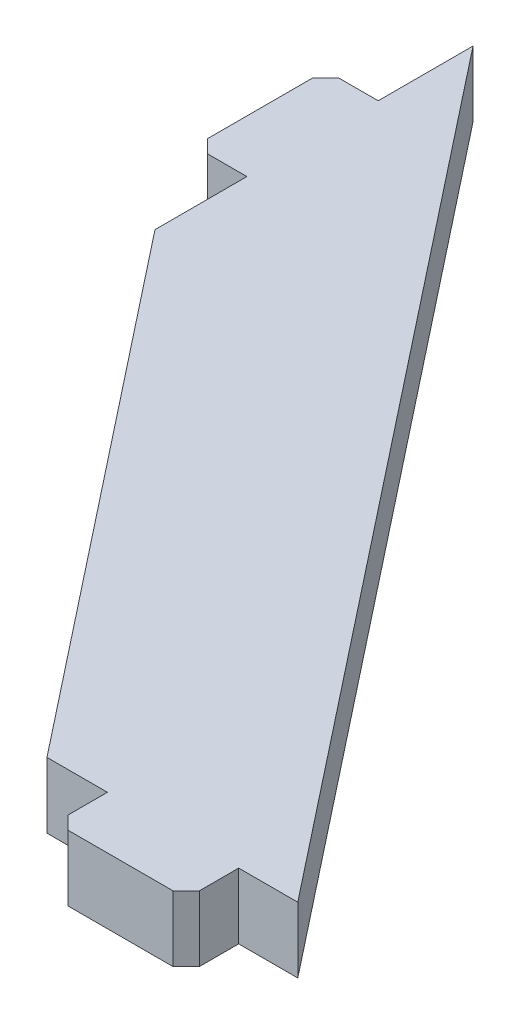
ISO-10303-21;
HEADER;
FILE_DESCRIPTION(('STEP AP214'),'2;1');
FILE_NAME('part.step','',(''),(''),'','','');
FILE_SCHEMA(('AUTOMOTIVE_DESIGN { 1 0 10303 214 1 1 1 1 }'));
ENDSEC;
DATA;
#1=APPLICATION_CONTEXT('core data for automotive mechanical design processes');
#2=APPLICATION_PROTOCOL_DEFINITION('international standard','automotive_design',2000,#1);
#3=PRODUCT_CONTEXT('',#1,'mechanical');
#4=PRODUCT('Part','Part','',(#3));
#5=PRODUCT_RELATED_PRODUCT_CATEGORY('part','',(#4));
#6=PRODUCT_DEFINITION_FORMATION('','',#4);
#7=PRODUCT_DEFINITION_CONTEXT('part definition',#1,'design');
#8=PRODUCT_DEFINITION('design','',#6,#7);
#9=PRODUCT_DEFINITION_SHAPE('','',#8);
#10=(LENGTH_UNIT() NAMED_UNIT(*) SI_UNIT(.MILLI.,.METRE.));
#11=(NAMED_UNIT(*) PLANE_ANGLE_UNIT() SI_UNIT($,.RADIAN.));
#12=(NAMED_UNIT(*) SI_UNIT($,.STERADIAN.) SOLID_ANGLE_UNIT());
#13=UNCERTAINTY_MEASURE_WITH_UNIT(LENGTH_MEASURE(1.E-05),#10,'distance_accuracy_value','');
#14=(GEOMETRIC_REPRESENTATION_CONTEXT(3) GLOBAL_UNCERTAINTY_ASSIGNED_CONTEXT((#13)) GLOBAL_UNIT_ASSIGNED_CONTEXT((#10,
#11,#12)) REPRESENTATION_CONTEXT('',''));
#15=CARTESIAN_POINT('',(0.,0.,0.));
#16=DIRECTION('',(0.,0.,1.));
#17=DIRECTION('',(1.,0.,0.));
#18=AXIS2_PLACEMENT_3D('',#15,#16,#17);
#19=CARTESIAN_POINT('',(-66.5,22.4999999999997,-9.28846153846134));
#20=DIRECTION('',(1.,0.,0.));
#21=DIRECTION('',(0.,0.,1.));
#22=AXIS2_PLACEMENT_3D('',#19,#20,#21);
#23=PLANE('',#22);
#24=DIRECTION('',(0.,0.,1.));
#25=VECTOR('',#24,1.);
#26=CARTESIAN_POINT('',(-66.5,22.4999999999997,-9.28846153846134));
#27=LINE('',#26,#25);
#28=CARTESIAN_POINT('',(-66.5000000000006,22.5,-91.8535742006211));
#29=VERTEX_POINT('',#28);
#30=CARTESIAN_POINT('',(-66.5000000000003,22.5,-77.8535742006211));
#31=VERTEX_POINT('',#30);
#32=EDGE_CURVE('E176',#29,#31,#27,.T.);
#33=ORIENTED_EDGE('',*,*,#32,.F.);
#34=CARTESIAN_POINT('',(-66.5000000000006,22.5,-91.8535742006211));
#35=CARTESIAN_POINT('',(-66.5000000000006,12.5,-91.8535742006211));
#36=B_SPLINE_CURVE_WITH_KNOTS('',1,(#34,#35),.UNSPECIFIED.,.F.,.F.,(2,2),(0.,0.166666666666667),.UNSPECIFIED.);
#37=CARTESIAN_POINT('',(-66.5000000000006,12.5,-91.8535742006211));
#38=VERTEX_POINT('',#37);
#39=EDGE_CURVE('E161',#29,#38,#36,.T.);
#40=ORIENTED_EDGE('',*,*,#39,.T.);
#41=DIRECTION('',(0.,0.,1.));
#42=VECTOR('',#41,1.);
#43=CARTESIAN_POINT('',(-66.5000000000004,12.4999999999997,-9.28846153846168));
#44=LINE('',#43,#42);
#45=CARTESIAN_POINT('',(-66.5000000000002,12.5,-77.8535742006211));
#46=VERTEX_POINT('',#45);
#47=EDGE_CURVE('E174',#38,#46,#44,.T.);
#48=ORIENTED_EDGE('',*,*,#47,.T.);
#49=DIRECTION('',(0.,1.,0.));
#50=VECTOR('',#49,1.);
#51=CARTESIAN_POINT('',(-66.5000000000003,22.5,-77.8535742006211));
#52=LINE('',#51,#50);
#53=EDGE_CURVE('E46',#46,#31,#52,.T.);
#54=ORIENTED_EDGE('',*,*,#53,.T.);
#55=EDGE_LOOP('',(#33,#40,#48,#54));
#56=FACE_BOUND('',#55,.T.);
#57=ADVANCED_FACE('F42',(#56),#23,.F.);
#58=CARTESIAN_POINT('',(-66.5000000000007,12.5000000000002,-126.300779169565));
#59=VERTEX_POINT('',#58);
#60=CARTESIAN_POINT('',(-66.5000000000003,12.5,-111.853574200621));
#61=VERTEX_POINT('',#60);
#62=EDGE_CURVE('E186',#59,#61,#44,.T.);
#63=ORIENTED_EDGE('',*,*,#62,.T.);
#64=CARTESIAN_POINT('',(-66.5000000000003,12.5,-111.853574200621));
#65=CARTESIAN_POINT('',(-66.5000000000003,22.5,-111.853574200621));
#66=B_SPLINE_CURVE_WITH_KNOTS('',1,(#64,#65),.UNSPECIFIED.,.F.,.F.,(2,2),(0.5,
0.666666666666667),.UNSPECIFIED.);
#67=CARTESIAN_POINT('',(-66.5000000000004,22.5,-111.853574200621));
#68=VERTEX_POINT('',#67);
#69=EDGE_CURVE('E170',#61,#68,#66,.T.);
#70=ORIENTED_EDGE('',*,*,#69,.T.);
#71=CARTESIAN_POINT('',(-66.5000000000008,22.5000000000002,-126.300779169565));
#72=VERTEX_POINT('',#71);
#73=EDGE_CURVE('E242',#72,#68,#27,.T.);
#74=ORIENTED_EDGE('',*,*,#73,.F.);
#75=DIRECTION('',(0.,1.,0.));
#76=VECTOR('',#75,1.);
#77=CARTESIAN_POINT('',(-66.5000000000008,22.5000000000002,-126.300779169565));
#78=LINE('',#77,#76);
#79=EDGE_CURVE('E209',#59,#72,#78,.T.);
#80=ORIENTED_EDGE('',*,*,#79,.F.);
#81=EDGE_LOOP('',(#63,#70,#74,#80));
#82=FACE_BOUND('',#81,.T.);
#83=ADVANCED_FACE('F373',(#82),#23,.F.);
#84=CARTESIAN_POINT('',(25.778135771357,22.5,3.88578058618805E-13));
#85=DIRECTION('',(0.,0.,-1.));
#86=DIRECTION('',(1.,0.,0.));
#87=AXIS2_PLACEMENT_3D('',#84,#85,#86);
#88=PLANE('',#87);
#89=CARTESIAN_POINT('',(24.1031929303425,12.5,1.73472347597681E-13));
#90=CARTESIAN_POINT('',(24.1031929303425,22.5,1.73472347597681E-13));
#91=B_SPLINE_CURVE_WITH_KNOTS('',1,(#89,#90),.UNSPECIFIED.,.F.,.F.,(2,2),(0.,0.166666666666667),.UNSPECIFIED.);
#92=CARTESIAN_POINT('',(24.1031929303425,12.5,1.73472347597681E-13));
#93=VERTEX_POINT('',#92);
#94=CARTESIAN_POINT('',(24.1031929303425,22.5,1.94289029309402E-13));
#95=VERTEX_POINT('',#94);
#96=EDGE_CURVE('E272',#93,#95,#91,.T.);
#97=ORIENTED_EDGE('',*,*,#96,.F.);
#98=DIRECTION('',(1.,0.,0.));
#99=VECTOR('',#98,1.);
#100=CARTESIAN_POINT('',(25.778135771357,12.5,1.73472347597681E-13));
#101=LINE('',#100,#99);
#102=CARTESIAN_POINT('',(33.1031929303425,12.5,1.73472347597681E-13));
#103=VERTEX_POINT('',#102);
#104=EDGE_CURVE('E206',#93,#103,#101,.T.);
#105=ORIENTED_EDGE('',*,*,#104,.T.);
#106=DIRECTION('',(0.,1.,0.));
#107=VECTOR('',#106,1.);
#108=CARTESIAN_POINT('',(33.1031929303425,22.5000000000006,1.94289029309402E-13));
#109=LINE('',#108,#107);
#110=CARTESIAN_POINT('',(33.1031929303425,22.5000000000006,1.94289029309402E-13));
#111=VERTEX_POINT('',#110);
#112=EDGE_CURVE('E52',#103,#111,#109,.T.);
#113=ORIENTED_EDGE('',*,*,#112,.T.);
#114=DIRECTION('',(1.,0.,0.));
#115=VECTOR('',#114,1.);
#116=CARTESIAN_POINT('',(25.778135771357,22.5,3.88578058618805E-13));
#117=LINE('',#116,#115);
#118=EDGE_CURVE('E67',#95,#111,#117,.T.);
#119=ORIENTED_EDGE('',*,*,#118,.F.);
#120=EDGE_LOOP('',(#97,#105,#113,#119));
#121=FACE_BOUND('',#120,.T.);
#122=ADVANCED_FACE('F217',(#121),#88,.F.);
#123=CARTESIAN_POINT('',(4.10319293034247,22.5,3.67761376907083E-13));
#124=CARTESIAN_POINT('',(4.1031929303425,12.5,1.73472347597681E-13));
#125=B_SPLINE_CURVE_WITH_KNOTS('',1,(#123,#124),.UNSPECIFIED.,.F.,.F.,(2,2),(0.5,
0.666666666666667),.UNSPECIFIED.);
#126=CARTESIAN_POINT('',(4.10319293034247,22.5,3.88578058618805E-13));
#127=VERTEX_POINT('',#126);
#128=CARTESIAN_POINT('',(4.1031929303425,12.5,1.73472347597681E-13));
#129=VERTEX_POINT('',#128);
#130=EDGE_CURVE('E278',#127,#129,#125,.T.);
#131=ORIENTED_EDGE('',*,*,#130,.F.);
#132=CARTESIAN_POINT('',(-5.10319293034245,22.5000000000004,1.94289029309402E-13));
#133=VERTEX_POINT('',#132);
#134=EDGE_CURVE('E226',#133,#127,#117,.T.);
#135=ORIENTED_EDGE('',*,*,#134,.F.);
#136=DIRECTION('',(0.,1.,0.));
#137=VECTOR('',#136,1.);
#138=CARTESIAN_POINT('',(-5.10319293034245,22.5000000000004,1.94289029309402E-13));
#139=LINE('',#138,#137);
#140=CARTESIAN_POINT('',(-5.10319293034242,12.5,1.73472347597681E-13));
#141=VERTEX_POINT('',#140);
#142=EDGE_CURVE('E11',#141,#133,#139,.T.);
#143=ORIENTED_EDGE('',*,*,#142,.F.);
#144=EDGE_CURVE('E203',#141,#129,#101,.T.);
#145=ORIENTED_EDGE('',*,*,#144,.T.);
#146=EDGE_LOOP('',(#131,#135,#143,#145));
#147=FACE_BOUND('',#146,.T.);
#148=ADVANCED_FACE('F396',(#147),#88,.F.);
#149=CARTESIAN_POINT('',(25.778135771357,22.5,-9.28846153846128));
#150=DIRECTION('',(-0.785209051423798,0.,0.619230769230777));
#151=DIRECTION('',(-0.619230769230777,0.,-0.785209051423798));
#152=AXIS2_PLACEMENT_3D('',#149,#150,#151);
#153=PLANE('',#152);
#154=ORIENTED_EDGE('',*,*,#112,.F.);
#155=DIRECTION('',(-0.619230769230777,0.,-0.785209051423798));
#156=VECTOR('',#155,1.);
#157=CARTESIAN_POINT('',(25.778135771357,12.5,-9.28846153846148));
#158=LINE('',#157,#156);
#159=EDGE_CURVE('E199',#103,#59,#158,.T.);
#160=ORIENTED_EDGE('',*,*,#159,.T.);
#161=ORIENTED_EDGE('',*,*,#79,.T.);
#162=DIRECTION('',(-0.619230769230777,0.,-0.785209051423798));
#163=VECTOR('',#162,1.);
#164=CARTESIAN_POINT('',(25.778135771357,22.5,-9.28846153846128));
#165=LINE('',#164,#163);
#166=EDGE_CURVE('E197',#111,#72,#165,.T.);
#167=ORIENTED_EDGE('',*,*,#166,.F.);
#168=EDGE_LOOP('',(#154,#160,#161,#167));
#169=FACE_BOUND('',#168,.T.);
#170=ADVANCED_FACE('F222',(#169),#153,.F.);
#171=CARTESIAN_POINT('',(2.22186422864303,22.5,9.28846153846178));
#172=DIRECTION('',(-0.785209051423798,0.,0.619230769230777));
#173=DIRECTION('',(-0.619230769230777,0.,-0.785209051423798));
#174=AXIS2_PLACEMENT_3D('',#171,#172,#173);
#175=PLANE('',#174);
#176=DIRECTION('',(-0.619230769230777,0.,-0.785209051423798));
#177=VECTOR('',#176,1.);
#178=CARTESIAN_POINT('',(2.22186422864305,12.5,9.28846153846182));
#179=LINE('',#178,#177);
#180=EDGE_CURVE('E184',#141,#46,#179,.T.);
#181=ORIENTED_EDGE('',*,*,#180,.F.);
#182=ORIENTED_EDGE('',*,*,#142,.T.);
#183=DIRECTION('',(-0.619230769230777,0.,-0.785209051423798));
#184=VECTOR('',#183,1.);
#185=CARTESIAN_POINT('',(2.22186422864303,22.5,9.28846153846178));
#186=LINE('',#185,#184);
#187=EDGE_CURVE('E237',#133,#31,#186,.T.);
#188=ORIENTED_EDGE('',*,*,#187,.T.);
#189=ORIENTED_EDGE('',*,*,#53,.F.);
#190=EDGE_LOOP('',(#181,#182,#188,#189));
#191=FACE_BOUND('',#190,.T.);
#192=ADVANCED_FACE('F44',(#191),#175,.T.);
#193=CARTESIAN_POINT('',(25.778135771357,22.5,-9.28846153846128));
#194=DIRECTION('',(0.,-1.,0.));
#195=DIRECTION('',(1.,0.,0.));
#196=AXIS2_PLACEMENT_3D('',#193,#194,#195);
#197=PLANE('',#196);
#198=ORIENTED_EDGE('',*,*,#73,.T.);
#199=DIRECTION('',(1.,0.,0.));
#200=VECTOR('',#199,1.);
#201=CARTESIAN_POINT('',(-82.5000000000004,22.5,-111.853574200621));
#202=LINE('',#201,#200);
#203=CARTESIAN_POINT('',(-72.5000000000004,22.5,-111.853574200621));
#204=VERTEX_POINT('',#203);
#205=EDGE_CURVE('E59',#204,#68,#202,.T.);
#206=ORIENTED_EDGE('',*,*,#205,.F.);
#207=DIRECTION('',(-0.707106781186545,0.,0.70710678118655));
#208=VECTOR('',#207,1.);
#209=CARTESIAN_POINT('',(-77.5000000000008,22.5,-106.853574200621));
#210=LINE('',#209,#208);
#211=CARTESIAN_POINT('',(-74.5000000000007,22.5,-109.853574200621));
#212=VERTEX_POINT('',#211);
#213=EDGE_CURVE('E309',#204,#212,#210,.T.);
#214=ORIENTED_EDGE('',*,*,#213,.T.);
#215=DIRECTION('',(0.,0.,-1.));
#216=VECTOR('',#215,1.);
#217=CARTESIAN_POINT('',(-74.5000000000004,22.5,-111.853574200621));
#218=LINE('',#217,#216);
#219=CARTESIAN_POINT('',(-74.5000000000003,22.5,-93.853574200621));
#220=VERTEX_POINT('',#219);
#221=EDGE_CURVE('E335',#220,#212,#218,.T.);
#222=ORIENTED_EDGE('',*,*,#221,.F.);
#223=DIRECTION('',(0.707106781186548,0.,0.707106781186548));
#224=VECTOR('',#223,1.);
#225=CARTESIAN_POINT('',(-87.5000000000007,22.5,-106.853574200621));
#226=LINE('',#225,#224);
#227=CARTESIAN_POINT('',(-72.5000000000007,22.5,-91.853574200621));
#228=VERTEX_POINT('',#227);
#229=EDGE_CURVE('E312',#220,#228,#226,.T.);
#230=ORIENTED_EDGE('',*,*,#229,.T.);
#231=DIRECTION('',(1.,0.,0.));
#232=VECTOR('',#231,1.);
#233=CARTESIAN_POINT('',(-82.5000000000008,22.5,-91.853574200621));
#234=LINE('',#233,#232);
#235=EDGE_CURVE('E341',#228,#29,#234,.T.);
#236=ORIENTED_EDGE('',*,*,#235,.T.);
#237=ORIENTED_EDGE('',*,*,#32,.T.);
#238=ORIENTED_EDGE('',*,*,#187,.F.);
#239=ORIENTED_EDGE('',*,*,#134,.T.);
#240=DIRECTION('',(0.,0.,-1.));
#241=VECTOR('',#240,1.);
#242=CARTESIAN_POINT('',(4.1031929303425,22.5,16.0000000000002));
#243=LINE('',#242,#241);
#244=CARTESIAN_POINT('',(4.10319293034249,22.5,6.00000000000038));
#245=VERTEX_POINT('',#244);
#246=EDGE_CURVE('E279',#245,#127,#243,.T.);
#247=ORIENTED_EDGE('',*,*,#246,.F.);
#248=DIRECTION('',(0.707106781186548,0.,0.707106781186548));
#249=VECTOR('',#248,1.);
#250=CARTESIAN_POINT('',(6.10319293034252,22.5,8.00000000000016));
#251=LINE('',#250,#249);
#252=CARTESIAN_POINT('',(6.1031929303425,22.5,8.00000000000013));
#253=VERTEX_POINT('',#252);
#254=EDGE_CURVE('E193',#245,#253,#251,.T.);
#255=ORIENTED_EDGE('',*,*,#254,.T.);
#256=DIRECTION('',(-1.,0.,0.));
#257=VECTOR('',#256,1.);
#258=CARTESIAN_POINT('',(24.1031929303425,22.5,8.00000000000019));
#259=LINE('',#258,#257);
#260=CARTESIAN_POINT('',(22.1031929303425,22.5,8.00000000000019));
#261=VERTEX_POINT('',#260);
#262=EDGE_CURVE('E267',#261,#253,#259,.T.);
#263=ORIENTED_EDGE('',*,*,#262,.F.);
#264=DIRECTION('',(0.707106781186548,0.,-0.707106781186547));
#265=VECTOR('',#264,1.);
#266=CARTESIAN_POINT('',(22.1031929303425,22.5,8.00000000000022));
#267=LINE('',#266,#265);
#268=CARTESIAN_POINT('',(24.1031929303425,22.5,6.00000000000019));
#269=VERTEX_POINT('',#268);
#270=EDGE_CURVE('E247',#261,#269,#267,.T.);
#271=ORIENTED_EDGE('',*,*,#270,.T.);
#272=DIRECTION('',(0.,0.,-1.));
#273=VECTOR('',#272,1.);
#274=CARTESIAN_POINT('',(24.1031929303425,22.5,16.0000000000002));
#275=LINE('',#274,#273);
#276=EDGE_CURVE('E282',#269,#95,#275,.T.);
#277=ORIENTED_EDGE('',*,*,#276,.T.);
#278=ORIENTED_EDGE('',*,*,#118,.T.);
#279=ORIENTED_EDGE('',*,*,#166,.T.);
#280=EDGE_LOOP('',(#198,#206,#214,#222,#230,#236,#237,#238,#239,#247,#255,#263,#271,#277,#278,#279));
#281=FACE_BOUND('',#280,.T.);
#282=ADVANCED_FACE('F398',(#281),#197,.F.);
#283=CARTESIAN_POINT('',(25.778135771357,12.5,-9.28846153846148));
#284=DIRECTION('',(0.,-1.,0.));
#285=DIRECTION('',(1.,0.,0.));
#286=AXIS2_PLACEMENT_3D('',#283,#284,#285);
#287=PLANE('',#286);
#288=ORIENTED_EDGE('',*,*,#62,.F.);
#289=ORIENTED_EDGE('',*,*,#159,.F.);
#290=ORIENTED_EDGE('',*,*,#104,.F.);
#291=DIRECTION('',(0.,0.,-1.));
#292=VECTOR('',#291,1.);
#293=CARTESIAN_POINT('',(24.1031929303425,12.5,16.0000000000002));
#294=LINE('',#293,#292);
#295=CARTESIAN_POINT('',(24.1031929303425,12.5,6.00000000000019));
#296=VERTEX_POINT('',#295);
#297=EDGE_CURVE('E268',#296,#93,#294,.T.);
#298=ORIENTED_EDGE('',*,*,#297,.F.);
#299=DIRECTION('',(-0.707106781186548,0.,0.707106781186547));
#300=VECTOR('',#299,1.);
#301=CARTESIAN_POINT('',(22.1031929303425,12.5,8.00000000000022));
#302=LINE('',#301,#300);
#303=CARTESIAN_POINT('',(22.1031929303425,12.5,8.00000000000019));
#304=VERTEX_POINT('',#303);
#305=EDGE_CURVE('E256',#296,#304,#302,.T.);
#306=ORIENTED_EDGE('',*,*,#305,.T.);
#307=DIRECTION('',(1.,0.,0.));
#308=VECTOR('',#307,1.);
#309=CARTESIAN_POINT('',(4.10319293034251,12.5,8.00000000000018));
#310=LINE('',#309,#308);
#311=CARTESIAN_POINT('',(6.10319293034251,12.5,8.00000000000019));
#312=VERTEX_POINT('',#311);
#313=EDGE_CURVE('E277',#312,#304,#310,.T.);
#314=ORIENTED_EDGE('',*,*,#313,.F.);
#315=DIRECTION('',(-0.707106781186548,0.,-0.707106781186548));
#316=VECTOR('',#315,1.);
#317=CARTESIAN_POINT('',(6.10319293034252,12.5,8.00000000000022));
#318=LINE('',#317,#316);
#319=CARTESIAN_POINT('',(4.1031929303425,12.5,6.00000000000019));
#320=VERTEX_POINT('',#319);
#321=EDGE_CURVE('E253',#312,#320,#318,.T.);
#322=ORIENTED_EDGE('',*,*,#321,.T.);
#323=DIRECTION('',(0.,0.,-1.));
#324=VECTOR('',#323,1.);
#325=CARTESIAN_POINT('',(4.10319293034251,12.5,16.0000000000002));
#326=LINE('',#325,#324);
#327=EDGE_CURVE('E273',#320,#129,#326,.T.);
#328=ORIENTED_EDGE('',*,*,#327,.T.);
#329=ORIENTED_EDGE('',*,*,#144,.F.);
#330=ORIENTED_EDGE('',*,*,#180,.T.);
#331=ORIENTED_EDGE('',*,*,#47,.F.);
#332=DIRECTION('',(1.,0.,0.));
#333=VECTOR('',#332,1.);
#334=CARTESIAN_POINT('',(-82.5000000000008,12.5,-91.853574200621));
#335=LINE('',#334,#333);
#336=CARTESIAN_POINT('',(-72.5000000000007,12.5,-91.853574200621));
#337=VERTEX_POINT('',#336);
#338=EDGE_CURVE('E157',#337,#38,#335,.T.);
#339=ORIENTED_EDGE('',*,*,#338,.F.);
#340=DIRECTION('',(-0.707106781186548,0.,-0.707106781186548));
#341=VECTOR('',#340,1.);
#342=CARTESIAN_POINT('',(-77.5000000000007,12.5,-96.8535742006211));
#343=LINE('',#342,#341);
#344=CARTESIAN_POINT('',(-74.5000000000003,12.5,-93.853574200621));
#345=VERTEX_POINT('',#344);
#346=EDGE_CURVE('E321',#337,#345,#343,.T.);
#347=ORIENTED_EDGE('',*,*,#346,.T.);
#348=DIRECTION('',(0.,0.,1.));
#349=VECTOR('',#348,1.);
#350=CARTESIAN_POINT('',(-74.5000000000007,12.5,-91.853574200621));
#351=LINE('',#350,#349);
#352=CARTESIAN_POINT('',(-74.5000000000008,12.5,-109.853574200621));
#353=VERTEX_POINT('',#352);
#354=EDGE_CURVE('E332',#353,#345,#351,.T.);
#355=ORIENTED_EDGE('',*,*,#354,.F.);
#356=DIRECTION('',(0.707106781186545,0.,-0.70710678118655));
#357=VECTOR('',#356,1.);
#358=CARTESIAN_POINT('',(-87.5000000000007,12.5,-96.8535742006209));
#359=LINE('',#358,#357);
#360=CARTESIAN_POINT('',(-72.5000000000004,12.5,-111.853574200621));
#361=VERTEX_POINT('',#360);
#362=EDGE_CURVE('E318',#353,#361,#359,.T.);
#363=ORIENTED_EDGE('',*,*,#362,.T.);
#364=DIRECTION('',(1.,0.,0.));
#365=VECTOR('',#364,1.);
#366=CARTESIAN_POINT('',(-82.5000000000004,12.5,-111.853574200621));
#367=LINE('',#366,#365);
#368=EDGE_CURVE('E169',#361,#61,#367,.T.);
#369=ORIENTED_EDGE('',*,*,#368,.T.);
#370=EDGE_LOOP('',(#288,#289,#290,#298,#306,#314,#322,#328,#329,#330,#331,#339,#347,#355,#363,#369));
#371=FACE_BOUND('',#370,.T.);
#372=ADVANCED_FACE('F181',(#371),#287,.T.);
#373=CARTESIAN_POINT('',(24.1031929303425,12.5,16.0000000000002));
#374=DIRECTION('',(-1.,0.,0.));
#375=DIRECTION('',(0.,0.,1.));
#376=AXIS2_PLACEMENT_3D('',#373,#374,#375);
#377=PLANE('',#376);
#378=ORIENTED_EDGE('',*,*,#276,.F.);
#379=DIRECTION('',(0.,-1.,0.));
#380=VECTOR('',#379,1.);
#381=CARTESIAN_POINT('',(24.1031929303425,12.5,6.00000000000019));
#382=LINE('',#381,#380);
#383=EDGE_CURVE('E187',#269,#296,#382,.T.);
#384=ORIENTED_EDGE('',*,*,#383,.T.);
#385=ORIENTED_EDGE('',*,*,#297,.T.);
#386=ORIENTED_EDGE('',*,*,#96,.T.);
#387=EDGE_LOOP('',(#378,#384,#385,#386));
#388=FACE_BOUND('',#387,.T.);
#389=ADVANCED_FACE('F378',(#388),#377,.F.);
#390=CARTESIAN_POINT('',(4.1031929303425,22.5,16.0000000000002));
#391=DIRECTION('',(1.,0.,0.));
#392=DIRECTION('',(0.,0.,-1.));
#393=AXIS2_PLACEMENT_3D('',#390,#391,#392);
#394=PLANE('',#393);
#395=ORIENTED_EDGE('',*,*,#327,.F.);
#396=DIRECTION('',(0.,1.,0.));
#397=VECTOR('',#396,1.);
#398=CARTESIAN_POINT('',(4.10319293034249,22.5,6.00000000000038));
#399=LINE('',#398,#397);
#400=EDGE_CURVE('E250',#320,#245,#399,.T.);
#401=ORIENTED_EDGE('',*,*,#400,.T.);
#402=ORIENTED_EDGE('',*,*,#246,.T.);
#403=ORIENTED_EDGE('',*,*,#130,.T.);
#404=EDGE_LOOP('',(#395,#401,#402,#403));
#405=FACE_BOUND('',#404,.T.);
#406=ADVANCED_FACE('F394',(#405),#394,.F.);
#407=CARTESIAN_POINT('',(0.,0.,8.00000000000019));
#408=DIRECTION('',(0.,0.,1.));
#409=DIRECTION('',(1.,0.,0.));
#410=AXIS2_PLACEMENT_3D('',#407,#408,#409);
#411=PLANE('',#410);
#412=ORIENTED_EDGE('',*,*,#262,.T.);
#413=DIRECTION('',(0.,-1.,0.));
#414=VECTOR('',#413,1.);
#415=CARTESIAN_POINT('',(6.10319293034251,12.5,8.00000000000019));
#416=LINE('',#415,#414);
#417=EDGE_CURVE('E259',#253,#312,#416,.T.);
#418=ORIENTED_EDGE('',*,*,#417,.T.);
#419=ORIENTED_EDGE('',*,*,#313,.T.);
#420=DIRECTION('',(0.,1.,0.));
#421=VECTOR('',#420,1.);
#422=CARTESIAN_POINT('',(22.1031929303425,22.5,8.00000000000019));
#423=LINE('',#422,#421);
#424=EDGE_CURVE('E263',#304,#261,#423,.T.);
#425=ORIENTED_EDGE('',*,*,#424,.T.);
#426=EDGE_LOOP('',(#412,#418,#419,#425));
#427=FACE_BOUND('',#426,.T.);
#428=ADVANCED_FACE('F385',(#427),#411,.T.);
#429=CARTESIAN_POINT('',(6.10319293034251,0.,8.00000000000019));
#430=DIRECTION('',(-0.707106781186548,0.,0.707106781186548));
#431=DIRECTION('',(0.,1.,0.));
#432=AXIS2_PLACEMENT_3D('',#429,#430,#431);
#433=PLANE('',#432);
#434=ORIENTED_EDGE('',*,*,#254,.F.);
#435=ORIENTED_EDGE('',*,*,#400,.F.);
#436=ORIENTED_EDGE('',*,*,#321,.F.);
#437=ORIENTED_EDGE('',*,*,#417,.F.);
#438=EDGE_LOOP('',(#434,#435,#436,#437));
#439=FACE_BOUND('',#438,.T.);
#440=ADVANCED_FACE('F390',(#439),#433,.T.);
#441=CARTESIAN_POINT('',(22.1031929303425,0.,8.0000000000002));
#442=DIRECTION('',(0.707106781186547,0.,0.707106781186548));
#443=DIRECTION('',(0.,-1.,0.));
#444=AXIS2_PLACEMENT_3D('',#441,#442,#443);
#445=PLANE('',#444);
#446=ORIENTED_EDGE('',*,*,#305,.F.);
#447=ORIENTED_EDGE('',*,*,#383,.F.);
#448=ORIENTED_EDGE('',*,*,#270,.F.);
#449=ORIENTED_EDGE('',*,*,#424,.F.);
#450=EDGE_LOOP('',(#446,#447,#448,#449));
#451=FACE_BOUND('',#450,.T.);
#452=ADVANCED_FACE('F381',(#451),#445,.T.);
#453=CARTESIAN_POINT('',(-82.5000000000008,22.5,-91.853574200621));
#454=DIRECTION('',(0.,0.,1.));
#455=DIRECTION('',(1.,0.,0.));
#456=AXIS2_PLACEMENT_3D('',#453,#454,#455);
#457=PLANE('',#456);
#458=ORIENTED_EDGE('',*,*,#235,.F.);
#459=DIRECTION('',(0.,-1.,0.));
#460=VECTOR('',#459,1.);
#461=CARTESIAN_POINT('',(-72.5000000000007,12.5,-91.853574200621));
#462=LINE('',#461,#460);
#463=EDGE_CURVE('E164',#228,#337,#462,.T.);
#464=ORIENTED_EDGE('',*,*,#463,.T.);
#465=ORIENTED_EDGE('',*,*,#338,.T.);
#466=ORIENTED_EDGE('',*,*,#39,.F.);
#467=EDGE_LOOP('',(#458,#464,#465,#466));
#468=FACE_BOUND('',#467,.T.);
#469=ADVANCED_FACE('F160',(#468),#457,.T.);
#470=CARTESIAN_POINT('',(-82.5000000000004,12.5,-111.853574200621));
#471=DIRECTION('',(0.,0.,-1.));
#472=DIRECTION('',(-1.,0.,0.));
#473=AXIS2_PLACEMENT_3D('',#470,#471,#472);
#474=PLANE('',#473);
#475=ORIENTED_EDGE('',*,*,#368,.F.);
#476=DIRECTION('',(0.,1.,0.));
#477=VECTOR('',#476,1.);
#478=CARTESIAN_POINT('',(-72.5000000000004,22.5,-111.853574200621));
#479=LINE('',#478,#477);
#480=EDGE_CURVE('E315',#361,#204,#479,.T.);
#481=ORIENTED_EDGE('',*,*,#480,.T.);
#482=ORIENTED_EDGE('',*,*,#205,.T.);
#483=ORIENTED_EDGE('',*,*,#69,.F.);
#484=EDGE_LOOP('',(#475,#481,#482,#483));
#485=FACE_BOUND('',#484,.T.);
#486=ADVANCED_FACE('F371',(#485),#474,.T.);
#487=CARTESIAN_POINT('',(-74.5,0.,2.77555756156289E-13));
#488=DIRECTION('',(1.,0.,0.));
#489=DIRECTION('',(0.,0.,-1.));
#490=AXIS2_PLACEMENT_3D('',#487,#488,#489);
#491=PLANE('',#490);
#492=ORIENTED_EDGE('',*,*,#221,.T.);
#493=DIRECTION('',(0.,-1.,0.));
#494=VECTOR('',#493,1.);
#495=CARTESIAN_POINT('',(-74.5000000000007,12.5,-109.853574200621));
#496=LINE('',#495,#494);
#497=EDGE_CURVE('E324',#212,#353,#496,.T.);
#498=ORIENTED_EDGE('',*,*,#497,.T.);
#499=ORIENTED_EDGE('',*,*,#354,.T.);
#500=DIRECTION('',(0.,1.,0.));
#501=VECTOR('',#500,1.);
#502=CARTESIAN_POINT('',(-74.5000000000003,22.5,-93.853574200621));
#503=LINE('',#502,#501);
#504=EDGE_CURVE('E328',#345,#220,#503,.T.);
#505=ORIENTED_EDGE('',*,*,#504,.T.);
#506=EDGE_LOOP('',(#492,#498,#499,#505));
#507=FACE_BOUND('',#506,.T.);
#508=ADVANCED_FACE('F363',(#507),#491,.F.);
#509=CARTESIAN_POINT('',(-74.5000000000007,0.,-109.853574200621));
#510=DIRECTION('',(-0.70710678118655,0.,-0.707106781186545));
#511=DIRECTION('',(0.,1.,0.));
#512=AXIS2_PLACEMENT_3D('',#509,#510,#511);
#513=PLANE('',#512);
#514=ORIENTED_EDGE('',*,*,#213,.F.);
#515=ORIENTED_EDGE('',*,*,#480,.F.);
#516=ORIENTED_EDGE('',*,*,#362,.F.);
#517=ORIENTED_EDGE('',*,*,#497,.F.);
#518=EDGE_LOOP('',(#514,#515,#516,#517));
#519=FACE_BOUND('',#518,.T.);
#520=ADVANCED_FACE('F368',(#519),#513,.T.);
#521=CARTESIAN_POINT('',(-74.5000000000003,0.,-93.8535742006211));
#522=DIRECTION('',(-0.707106781186547,0.,0.707106781186547));
#523=DIRECTION('',(0.,-1.,0.));
#524=AXIS2_PLACEMENT_3D('',#521,#522,#523);
#525=PLANE('',#524);
#526=ORIENTED_EDGE('',*,*,#346,.F.);
#527=ORIENTED_EDGE('',*,*,#463,.F.);
#528=ORIENTED_EDGE('',*,*,#229,.F.);
#529=ORIENTED_EDGE('',*,*,#504,.F.);
#530=EDGE_LOOP('',(#526,#527,#528,#529));
#531=FACE_BOUND('',#530,.T.);
#532=ADVANCED_FACE('F403',(#531),#525,.T.);
#533=CLOSED_SHELL('',(#57,#83,#122,#148,#170,#192,#282,#372,#389,#406,#428,#440,#452,#469,#486,
#508,#520,#532));
#534=MANIFOLD_SOLID_BREP('B2',#533);
#535=ADVANCED_BREP_SHAPE_REPRESENTATION('',(#18,#534),#14);
#536=SHAPE_DEFINITION_REPRESENTATION(#9,#535);
ENDSEC;
END-ISO-10303-21;
